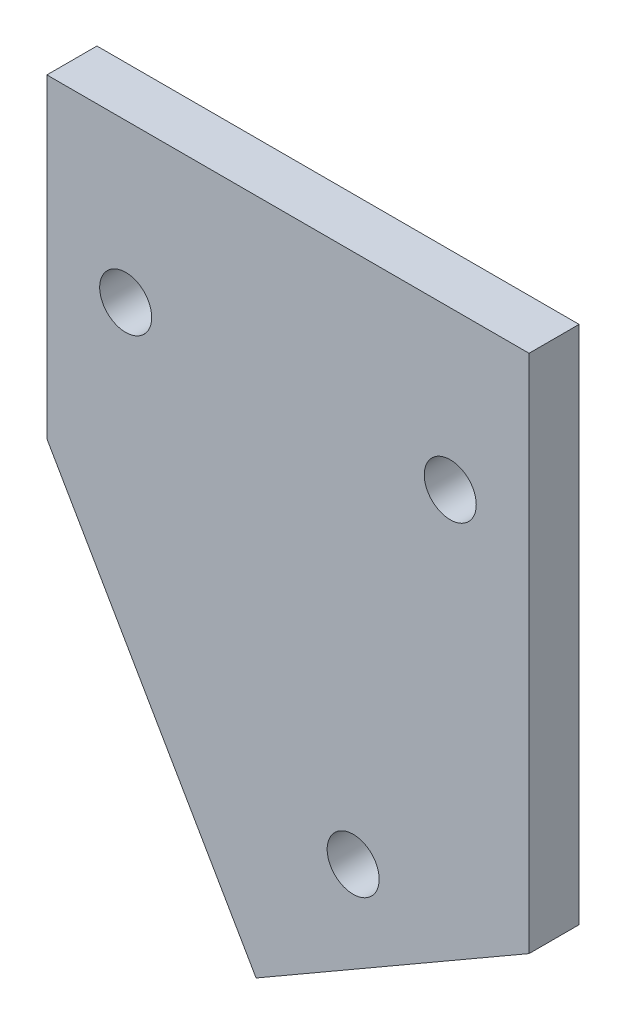
ISO-10303-21;
HEADER;
FILE_DESCRIPTION(('STEP AP214'),'2;1');
FILE_NAME('part.step','',(''),(''),'','','');
FILE_SCHEMA(('AUTOMOTIVE_DESIGN { 1 0 10303 214 1 1 1 1 }'));
ENDSEC;
DATA;
#1=APPLICATION_CONTEXT('core data for automotive mechanical design processes');
#2=APPLICATION_PROTOCOL_DEFINITION('international standard','automotive_design',2000,#1);
#3=PRODUCT_CONTEXT('',#1,'mechanical');
#4=PRODUCT('Part','Part','',(#3));
#5=PRODUCT_RELATED_PRODUCT_CATEGORY('part','',(#4));
#6=PRODUCT_DEFINITION_FORMATION('','',#4);
#7=PRODUCT_DEFINITION_CONTEXT('part definition',#1,'design');
#8=PRODUCT_DEFINITION('design','',#6,#7);
#9=PRODUCT_DEFINITION_SHAPE('','',#8);
#10=(LENGTH_UNIT() NAMED_UNIT(*) SI_UNIT(.MILLI.,.METRE.));
#11=(NAMED_UNIT(*) PLANE_ANGLE_UNIT() SI_UNIT($,.RADIAN.));
#12=(NAMED_UNIT(*) SI_UNIT($,.STERADIAN.) SOLID_ANGLE_UNIT());
#13=UNCERTAINTY_MEASURE_WITH_UNIT(LENGTH_MEASURE(1.E-05),#10,'distance_accuracy_value','');
#14=(GEOMETRIC_REPRESENTATION_CONTEXT(3) GLOBAL_UNCERTAINTY_ASSIGNED_CONTEXT((#13)) GLOBAL_UNIT_ASSIGNED_CONTEXT((#10,
#11,#12)) REPRESENTATION_CONTEXT('',''));
#15=CARTESIAN_POINT('',(0.,0.,0.));
#16=DIRECTION('',(0.,0.,1.));
#17=DIRECTION('',(1.,0.,0.));
#18=AXIS2_PLACEMENT_3D('',#15,#16,#17);
#19=CARTESIAN_POINT('',(0.,0.,3.175));
#20=DIRECTION('',(0.,0.,-1.));
#21=DIRECTION('',(-1.,0.,0.));
#22=AXIS2_PLACEMENT_3D('',#19,#20,#21);
#23=PLANE('',#22);
#24=DIRECTION('',(0.,-1.,0.));
#25=VECTOR('',#24,1.);
#26=CARTESIAN_POINT('',(0.,20.,3.175));
#27=LINE('',#26,#25);
#28=CARTESIAN_POINT('',(0.,20.,3.175));
#29=VERTEX_POINT('',#28);
#30=CARTESIAN_POINT('',(0.,0.,3.175));
#31=VERTEX_POINT('',#30);
#32=EDGE_CURVE('E125',#29,#31,#27,.T.);
#33=ORIENTED_EDGE('',*,*,#32,.T.);
#34=DIRECTION('',(0.499999999999995,-0.866025403784441,0.));
#35=VECTOR('',#34,1.);
#36=CARTESIAN_POINT('',(0.,0.,3.175));
#37=LINE('',#36,#35);
#38=CARTESIAN_POINT('',(13.2735026918962,-22.9903810567668,3.175));
#39=VERTEX_POINT('',#38);
#40=EDGE_CURVE('E92',#31,#39,#37,.T.);
#41=ORIENTED_EDGE('',*,*,#40,.T.);
#42=DIRECTION('',(0.866025403784442,0.499999999999995,0.));
#43=VECTOR('',#42,1.);
#44=CARTESIAN_POINT('',(13.2735026918962,-22.9903810567668,3.175));
#45=LINE('',#44,#43);
#46=CARTESIAN_POINT('',(30.5940107675851,-12.9903810567669,3.175));
#47=VERTEX_POINT('',#46);
#48=EDGE_CURVE('E96',#39,#47,#45,.T.);
#49=ORIENTED_EDGE('',*,*,#48,.T.);
#50=DIRECTION('',(0.,1.,0.));
#51=VECTOR('',#50,1.);
#52=CARTESIAN_POINT('',(30.5940107675851,-12.9903810567669,3.175));
#53=LINE('',#52,#51);
#54=CARTESIAN_POINT('',(30.5940107675851,20.,3.175));
#55=VERTEX_POINT('',#54);
#56=EDGE_CURVE('E100',#47,#55,#53,.T.);
#57=ORIENTED_EDGE('',*,*,#56,.T.);
#58=DIRECTION('',(-1.,0.,0.));
#59=VECTOR('',#58,1.);
#60=CARTESIAN_POINT('',(30.5940107675851,20.,3.175));
#61=LINE('',#60,#59);
#62=EDGE_CURVE('E58',#55,#29,#61,.T.);
#63=ORIENTED_EDGE('',*,*,#62,.T.);
#64=EDGE_LOOP('',(#33,#41,#49,#57,#63));
#65=FACE_BOUND('',#64,.T.);
#66=CARTESIAN_POINT('',(19.4337567297407,-13.6602540378447,3.175));
#67=DIRECTION('',(0.,0.,1.));
#68=DIRECTION('',(1.,0.,0.));
#69=AXIS2_PLACEMENT_3D('',#66,#67,#68);
#70=CIRCLE('',#69,1.64999999999999);
#71=CARTESIAN_POINT('',(21.0837567297407,-13.6602540378447,3.175));
#72=VERTEX_POINT('',#71);
#73=EDGE_CURVE('E120',#72,#72,#70,.T.);
#74=ORIENTED_EDGE('',*,*,#73,.F.);
#75=EDGE_LOOP('',(#74));
#76=FACE_BOUND('',#75,.T.);
#77=CARTESIAN_POINT('',(5.,10.,3.175));
#78=DIRECTION('',(0.,0.,1.));
#79=DIRECTION('',(1.,0.,0.));
#80=AXIS2_PLACEMENT_3D('',#77,#78,#79);
#81=CIRCLE('',#80,1.65);
#82=CARTESIAN_POINT('',(6.65,10.,3.175));
#83=VERTEX_POINT('',#82);
#84=EDGE_CURVE('E174',#83,#83,#81,.T.);
#85=ORIENTED_EDGE('',*,*,#84,.F.);
#86=EDGE_LOOP('',(#85));
#87=FACE_BOUND('',#86,.T.);
#88=CARTESIAN_POINT('',(25.5940107675851,10.,3.175));
#89=DIRECTION('',(0.,0.,1.));
#90=DIRECTION('',(1.,0.,0.));
#91=AXIS2_PLACEMENT_3D('',#88,#89,#90);
#92=CIRCLE('',#91,1.65);
#93=CARTESIAN_POINT('',(27.2440107675851,10.,3.175));
#94=VERTEX_POINT('',#93);
#95=EDGE_CURVE('E165',#94,#94,#92,.T.);
#96=ORIENTED_EDGE('',*,*,#95,.F.);
#97=EDGE_LOOP('',(#96));
#98=FACE_BOUND('',#97,.T.);
#99=ADVANCED_FACE('F41',(#65,#76,#87,#98),#23,.F.);
#100=CARTESIAN_POINT('',(0.,0.,0.));
#101=DIRECTION('',(0.,0.,-1.));
#102=DIRECTION('',(-1.,0.,0.));
#103=AXIS2_PLACEMENT_3D('',#100,#101,#102);
#104=PLANE('',#103);
#105=CARTESIAN_POINT('',(5.,10.,0.));
#106=DIRECTION('',(0.,0.,1.));
#107=DIRECTION('',(1.,0.,0.));
#108=AXIS2_PLACEMENT_3D('',#105,#106,#107);
#109=CIRCLE('',#108,1.65);
#110=CARTESIAN_POINT('',(6.65,10.,0.));
#111=VERTEX_POINT('',#110);
#112=EDGE_CURVE('E171',#111,#111,#109,.T.);
#113=ORIENTED_EDGE('',*,*,#112,.T.);
#114=EDGE_LOOP('',(#113));
#115=FACE_BOUND('',#114,.T.);
#116=DIRECTION('',(0.,-1.,0.));
#117=VECTOR('',#116,1.);
#118=CARTESIAN_POINT('',(0.,20.,0.));
#119=LINE('',#118,#117);
#120=CARTESIAN_POINT('',(0.,20.,0.));
#121=VERTEX_POINT('',#120);
#122=CARTESIAN_POINT('',(0.,0.,0.));
#123=VERTEX_POINT('',#122);
#124=EDGE_CURVE('E116',#121,#123,#119,.T.);
#125=ORIENTED_EDGE('',*,*,#124,.F.);
#126=DIRECTION('',(-1.,0.,0.));
#127=VECTOR('',#126,1.);
#128=CARTESIAN_POINT('',(30.5940107675851,20.,0.));
#129=LINE('',#128,#127);
#130=CARTESIAN_POINT('',(30.5940107675851,20.,0.));
#131=VERTEX_POINT('',#130);
#132=EDGE_CURVE('E84',#131,#121,#129,.T.);
#133=ORIENTED_EDGE('',*,*,#132,.F.);
#134=DIRECTION('',(0.,1.,0.));
#135=VECTOR('',#134,1.);
#136=CARTESIAN_POINT('',(30.5940107675851,-12.9903810567669,0.));
#137=LINE('',#136,#135);
#138=CARTESIAN_POINT('',(30.5940107675851,-12.9903810567669,0.));
#139=VERTEX_POINT('',#138);
#140=EDGE_CURVE('E78',#139,#131,#137,.T.);
#141=ORIENTED_EDGE('',*,*,#140,.F.);
#142=DIRECTION('',(0.866025403784442,0.499999999999995,0.));
#143=VECTOR('',#142,1.);
#144=CARTESIAN_POINT('',(13.2735026918962,-22.9903810567668,0.));
#145=LINE('',#144,#143);
#146=CARTESIAN_POINT('',(13.2735026918962,-22.9903810567668,0.));
#147=VERTEX_POINT('',#146);
#148=EDGE_CURVE('E107',#147,#139,#145,.T.);
#149=ORIENTED_EDGE('',*,*,#148,.F.);
#150=DIRECTION('',(0.499999999999995,-0.866025403784441,0.));
#151=VECTOR('',#150,1.);
#152=CARTESIAN_POINT('',(0.,0.,0.));
#153=LINE('',#152,#151);
#154=EDGE_CURVE('E119',#123,#147,#153,.T.);
#155=ORIENTED_EDGE('',*,*,#154,.F.);
#156=EDGE_LOOP('',(#125,#133,#141,#149,#155));
#157=FACE_BOUND('',#156,.T.);
#158=CARTESIAN_POINT('',(19.4337567297407,-13.6602540378447,0.));
#159=DIRECTION('',(0.,0.,1.));
#160=DIRECTION('',(1.,0.,0.));
#161=AXIS2_PLACEMENT_3D('',#158,#159,#160);
#162=CIRCLE('',#161,1.64999999999999);
#163=CARTESIAN_POINT('',(21.0837567297407,-13.6602540378447,0.));
#164=VERTEX_POINT('',#163);
#165=EDGE_CURVE('E177',#164,#164,#162,.T.);
#166=ORIENTED_EDGE('',*,*,#165,.T.);
#167=EDGE_LOOP('',(#166));
#168=FACE_BOUND('',#167,.T.);
#169=CARTESIAN_POINT('',(25.5940107675851,10.,0.));
#170=DIRECTION('',(0.,0.,1.));
#171=DIRECTION('',(1.,0.,0.));
#172=AXIS2_PLACEMENT_3D('',#169,#170,#171);
#173=CIRCLE('',#172,1.65);
#174=CARTESIAN_POINT('',(27.2440107675851,10.,0.));
#175=VERTEX_POINT('',#174);
#176=EDGE_CURVE('E168',#175,#175,#173,.T.);
#177=ORIENTED_EDGE('',*,*,#176,.T.);
#178=EDGE_LOOP('',(#177));
#179=FACE_BOUND('',#178,.T.);
#180=ADVANCED_FACE('F129',(#115,#157,#168,#179),#104,.T.);
#181=CARTESIAN_POINT('',(0.,20.,3.175));
#182=DIRECTION('',(1.,0.,0.));
#183=DIRECTION('',(0.,0.,-1.));
#184=AXIS2_PLACEMENT_3D('',#181,#182,#183);
#185=PLANE('',#184);
#186=ORIENTED_EDGE('',*,*,#124,.T.);
#187=DIRECTION('',(0.,0.,-1.));
#188=VECTOR('',#187,1.);
#189=CARTESIAN_POINT('',(0.,0.,3.175));
#190=LINE('',#189,#188);
#191=EDGE_CURVE('E11',#31,#123,#190,.T.);
#192=ORIENTED_EDGE('',*,*,#191,.F.);
#193=ORIENTED_EDGE('',*,*,#32,.F.);
#194=DIRECTION('',(0.,0.,-1.));
#195=VECTOR('',#194,1.);
#196=CARTESIAN_POINT('',(0.,20.,3.175));
#197=LINE('',#196,#195);
#198=EDGE_CURVE('E112',#29,#121,#197,.T.);
#199=ORIENTED_EDGE('',*,*,#198,.T.);
#200=EDGE_LOOP('',(#186,#192,#193,#199));
#201=FACE_BOUND('',#200,.T.);
#202=ADVANCED_FACE('F43',(#201),#185,.F.);
#203=CARTESIAN_POINT('',(0.,0.,3.175));
#204=DIRECTION('',(0.866025403784441,0.499999999999995,0.));
#205=DIRECTION('',(-0.499999999999995,0.866025403784441,0.));
#206=AXIS2_PLACEMENT_3D('',#203,#204,#205);
#207=PLANE('',#206);
#208=ORIENTED_EDGE('',*,*,#154,.T.);
#209=DIRECTION('',(0.,0.,-1.));
#210=VECTOR('',#209,1.);
#211=CARTESIAN_POINT('',(13.2735026918962,-22.9903810567668,3.175));
#212=LINE('',#211,#210);
#213=EDGE_CURVE('E50',#39,#147,#212,.T.);
#214=ORIENTED_EDGE('',*,*,#213,.F.);
#215=ORIENTED_EDGE('',*,*,#40,.F.);
#216=ORIENTED_EDGE('',*,*,#191,.T.);
#217=EDGE_LOOP('',(#208,#214,#215,#216));
#218=FACE_BOUND('',#217,.T.);
#219=ADVANCED_FACE('F222',(#218),#207,.F.);
#220=CARTESIAN_POINT('',(13.2735026918962,-22.9903810567668,3.175));
#221=DIRECTION('',(-0.499999999999995,0.866025403784442,0.));
#222=DIRECTION('',(-0.866025403784442,-0.499999999999995,0.));
#223=AXIS2_PLACEMENT_3D('',#220,#221,#222);
#224=PLANE('',#223);
#225=ORIENTED_EDGE('',*,*,#148,.T.);
#226=DIRECTION('',(0.,0.,-1.));
#227=VECTOR('',#226,1.);
#228=CARTESIAN_POINT('',(30.5940107675851,-12.9903810567669,3.175));
#229=LINE('',#228,#227);
#230=EDGE_CURVE('E104',#47,#139,#229,.T.);
#231=ORIENTED_EDGE('',*,*,#230,.F.);
#232=ORIENTED_EDGE('',*,*,#48,.F.);
#233=ORIENTED_EDGE('',*,*,#213,.T.);
#234=EDGE_LOOP('',(#225,#231,#232,#233));
#235=FACE_BOUND('',#234,.T.);
#236=ADVANCED_FACE('F105',(#235),#224,.F.);
#237=CARTESIAN_POINT('',(30.5940107675851,-12.9903810567669,3.175));
#238=DIRECTION('',(-1.,0.,0.));
#239=DIRECTION('',(0.,-1.,0.));
#240=AXIS2_PLACEMENT_3D('',#237,#238,#239);
#241=PLANE('',#240);
#242=ORIENTED_EDGE('',*,*,#140,.T.);
#243=DIRECTION('',(0.,0.,-1.));
#244=VECTOR('',#243,1.);
#245=CARTESIAN_POINT('',(30.5940107675851,20.,3.175));
#246=LINE('',#245,#244);
#247=EDGE_CURVE('E108',#55,#131,#246,.T.);
#248=ORIENTED_EDGE('',*,*,#247,.F.);
#249=ORIENTED_EDGE('',*,*,#56,.F.);
#250=ORIENTED_EDGE('',*,*,#230,.T.);
#251=EDGE_LOOP('',(#242,#248,#249,#250));
#252=FACE_BOUND('',#251,.T.);
#253=ADVANCED_FACE('F110',(#252),#241,.F.);
#254=CARTESIAN_POINT('',(30.5940107675851,20.,3.175));
#255=DIRECTION('',(0.,-1.,0.));
#256=DIRECTION('',(1.,0.,0.));
#257=AXIS2_PLACEMENT_3D('',#254,#255,#256);
#258=PLANE('',#257);
#259=ORIENTED_EDGE('',*,*,#132,.T.);
#260=ORIENTED_EDGE('',*,*,#198,.F.);
#261=ORIENTED_EDGE('',*,*,#62,.F.);
#262=ORIENTED_EDGE('',*,*,#247,.T.);
#263=EDGE_LOOP('',(#259,#260,#261,#262));
#264=FACE_BOUND('',#263,.T.);
#265=ADVANCED_FACE('F134',(#264),#258,.F.);
#266=CARTESIAN_POINT('',(19.4337567297407,-13.6602540378447,3.175));
#267=DIRECTION('',(0.,0.,-1.));
#268=DIRECTION('',(-1.,0.,0.));
#269=AXIS2_PLACEMENT_3D('',#266,#267,#268);
#270=CYLINDRICAL_SURFACE('',#269,1.64999999999999);
#271=ORIENTED_EDGE('',*,*,#73,.T.);
#272=EDGE_LOOP('',(#271));
#273=FACE_BOUND('',#272,.T.);
#274=ORIENTED_EDGE('',*,*,#165,.F.);
#275=EDGE_LOOP('',(#274));
#276=FACE_BOUND('',#275,.T.);
#277=ADVANCED_FACE('F136',(#273,#276),#270,.F.);
#278=CARTESIAN_POINT('',(5.,10.,3.175));
#279=DIRECTION('',(0.,0.,-1.));
#280=DIRECTION('',(-1.,0.,0.));
#281=AXIS2_PLACEMENT_3D('',#278,#279,#280);
#282=CYLINDRICAL_SURFACE('',#281,1.65);
#283=ORIENTED_EDGE('',*,*,#84,.T.);
#284=EDGE_LOOP('',(#283));
#285=FACE_BOUND('',#284,.T.);
#286=ORIENTED_EDGE('',*,*,#112,.F.);
#287=EDGE_LOOP('',(#286));
#288=FACE_BOUND('',#287,.T.);
#289=ADVANCED_FACE('F142',(#285,#288),#282,.F.);
#290=CARTESIAN_POINT('',(25.5940107675851,10.,3.175));
#291=DIRECTION('',(0.,0.,-1.));
#292=DIRECTION('',(-1.,0.,0.));
#293=AXIS2_PLACEMENT_3D('',#290,#291,#292);
#294=CYLINDRICAL_SURFACE('',#293,1.65);
#295=ORIENTED_EDGE('',*,*,#95,.T.);
#296=EDGE_LOOP('',(#295));
#297=FACE_BOUND('',#296,.T.);
#298=ORIENTED_EDGE('',*,*,#176,.F.);
#299=EDGE_LOOP('',(#298));
#300=FACE_BOUND('',#299,.T.);
#301=ADVANCED_FACE('F156',(#297,#300),#294,.F.);
#302=CLOSED_SHELL('',(#99,#180,#202,#219,#236,#253,#265,#277,#289,#301));
#303=MANIFOLD_SOLID_BREP('B2',#302);
#304=ADVANCED_BREP_SHAPE_REPRESENTATION('',(#18,#303),#14);
#305=SHAPE_DEFINITION_REPRESENTATION(#9,#304);
ENDSEC;
END-ISO-10303-21;
